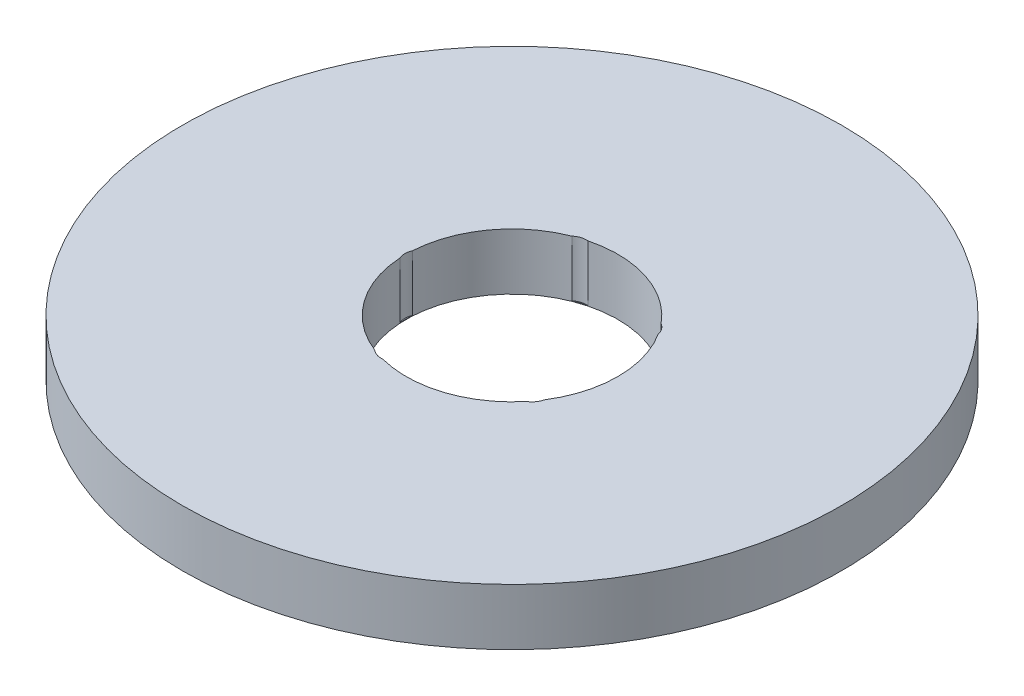
ISO-10303-21;
HEADER;
FILE_DESCRIPTION(('STEP AP214'),'2;1');
FILE_NAME('part.step','',(''),(''),'','','');
FILE_SCHEMA(('AUTOMOTIVE_DESIGN { 1 0 10303 214 1 1 1 1 }'));
ENDSEC;
DATA;
#1=APPLICATION_CONTEXT('core data for automotive mechanical design processes');
#2=APPLICATION_PROTOCOL_DEFINITION('international standard','automotive_design',2000,#1);
#3=PRODUCT_CONTEXT('',#1,'mechanical');
#4=PRODUCT('Part','Part','',(#3));
#5=PRODUCT_RELATED_PRODUCT_CATEGORY('part','',(#4));
#6=PRODUCT_DEFINITION_FORMATION('','',#4);
#7=PRODUCT_DEFINITION_CONTEXT('part definition',#1,'design');
#8=PRODUCT_DEFINITION('design','',#6,#7);
#9=PRODUCT_DEFINITION_SHAPE('','',#8);
#10=(LENGTH_UNIT() NAMED_UNIT(*) SI_UNIT(.MILLI.,.METRE.));
#11=(NAMED_UNIT(*) PLANE_ANGLE_UNIT() SI_UNIT($,.RADIAN.));
#12=(NAMED_UNIT(*) SI_UNIT($,.STERADIAN.) SOLID_ANGLE_UNIT());
#13=UNCERTAINTY_MEASURE_WITH_UNIT(LENGTH_MEASURE(1.E-05),#10,'distance_accuracy_value','');
#14=(GEOMETRIC_REPRESENTATION_CONTEXT(3) GLOBAL_UNCERTAINTY_ASSIGNED_CONTEXT((#13)) GLOBAL_UNIT_ASSIGNED_CONTEXT((#10,
#11,#12)) REPRESENTATION_CONTEXT('',''));
#15=CARTESIAN_POINT('',(0.,0.,0.));
#16=DIRECTION('',(0.,0.,1.));
#17=DIRECTION('',(1.,0.,0.));
#18=AXIS2_PLACEMENT_3D('',#15,#16,#17);
#19=CARTESIAN_POINT('',(0.,12.,0.));
#20=DIRECTION('',(0.,-1.,0.));
#21=DIRECTION('',(0.,0.,-1.));
#22=AXIS2_PLACEMENT_3D('',#19,#20,#21);
#23=CYLINDRICAL_SURFACE('',#22,70.);
#24=CARTESIAN_POINT('',(0.,12.,0.));
#25=DIRECTION('',(0.,1.,0.));
#26=DIRECTION('',(0.,0.,1.));
#27=AXIS2_PLACEMENT_3D('',#24,#25,#26);
#28=CIRCLE('',#27,70.);
#29=CARTESIAN_POINT('',(0.,12.,70.));
#30=VERTEX_POINT('',#29);
#31=EDGE_CURVE('E159',#30,#30,#28,.T.);
#32=ORIENTED_EDGE('',*,*,#31,.F.);
#33=EDGE_LOOP('',(#32));
#34=FACE_BOUND('',#33,.T.);
#35=CARTESIAN_POINT('',(0.,0.,0.));
#36=DIRECTION('',(0.,1.,0.));
#37=DIRECTION('',(0.,0.,1.));
#38=AXIS2_PLACEMENT_3D('',#35,#36,#37);
#39=CIRCLE('',#38,70.);
#40=CARTESIAN_POINT('',(0.,0.,70.));
#41=VERTEX_POINT('',#40);
#42=EDGE_CURVE('E152',#41,#41,#39,.T.);
#43=ORIENTED_EDGE('',*,*,#42,.T.);
#44=EDGE_LOOP('',(#43));
#45=FACE_BOUND('',#44,.T.);
#46=ADVANCED_FACE('F39',(#34,#45),#23,.T.);
#47=CARTESIAN_POINT('',(0.,12.,0.));
#48=DIRECTION('',(0.,1.,0.));
#49=DIRECTION('',(0.,0.,1.));
#50=AXIS2_PLACEMENT_3D('',#47,#48,#49);
#51=PLANE('',#50);
#52=CARTESIAN_POINT('',(-5.99042300739143,12.,18.4366262705647));
#53=DIRECTION('',(0.,1.,0.));
#54=DIRECTION('',(0.951056516295155,0.,0.309016994374945));
#55=AXIS2_PLACEMENT_3D('',#52,#53,#54);
#56=CIRCLE('',#55,3.35702302504497);
#57=CARTESIAN_POINT('',(-8.22321581409776,12.,20.943464891817));
#58=VERTEX_POINT('',#57);
#59=CARTESIAN_POINT('',(-5.65753845329719,12.,21.77710400052));
#60=VERTEX_POINT('',#59);
#61=EDGE_CURVE('E192',#58,#60,#56,.T.);
#62=ORIENTED_EDGE('',*,*,#61,.F.);
#63=CARTESIAN_POINT('',(0.,12.,0.));
#64=DIRECTION('',(0.,1.,0.));
#65=DIRECTION('',(0.,0.,1.));
#66=AXIS2_PLACEMENT_3D('',#63,#64,#65);
#67=CIRCLE('',#66,22.5);
#68=CARTESIAN_POINT('',(-22.4595321941304,12.,1.34885641223256));
#69=VERTEX_POINT('',#68);
#70=EDGE_CURVE('E147',#69,#58,#67,.T.);
#71=ORIENTED_EDGE('',*,*,#70,.F.);
#72=CARTESIAN_POINT('',(-19.3854160658976,12.,0.));
#73=DIRECTION('',(0.,1.,0.));
#74=DIRECTION('',(0.,0.,1.));
#75=AXIS2_PLACEMENT_3D('',#72,#73,#74);
#76=CIRCLE('',#75,3.35702302504497);
#77=CARTESIAN_POINT('',(-22.4595321941304,12.,-1.34885641223256));
#78=VERTEX_POINT('',#77);
#79=EDGE_CURVE('E154',#78,#69,#76,.T.);
#80=ORIENTED_EDGE('',*,*,#79,.F.);
#81=CARTESIAN_POINT('',(-8.22321581409805,12.,-20.9434648918169));
#82=VERTEX_POINT('',#81);
#83=EDGE_CURVE('E136',#82,#78,#67,.T.);
#84=ORIENTED_EDGE('',*,*,#83,.F.);
#85=CARTESIAN_POINT('',(-5.99042300739169,12.,-18.4366262705646));
#86=DIRECTION('',(0.,1.,0.));
#87=DIRECTION('',(-0.95105651629515,0.,0.309016994374958));
#88=AXIS2_PLACEMENT_3D('',#85,#86,#87);
#89=CIRCLE('',#88,3.35702302504497);
#90=CARTESIAN_POINT('',(-5.65753845329751,12.,-21.7771040005199));
#91=VERTEX_POINT('',#90);
#92=EDGE_CURVE('E117',#91,#82,#89,.T.);
#93=ORIENTED_EDGE('',*,*,#92,.F.);
#94=CARTESIAN_POINT('',(17.3773053241922,12.,-14.2926295575658));
#95=VERTEX_POINT('',#94);
#96=EDGE_CURVE('E133',#95,#91,#67,.T.);
#97=ORIENTED_EDGE('',*,*,#96,.F.);
#98=CARTESIAN_POINT('',(15.6831310403402,12.,-11.3944616730883));
#99=DIRECTION('',(0.,1.,0.));
#100=DIRECTION('',(-0.58778525229248,0.,-0.809016994374942));
#101=AXIS2_PLACEMENT_3D('',#98,#99,#100);
#102=CIRCLE('',#101,3.35702302504497);
#103=CARTESIAN_POINT('',(18.9629811373331,12.,-12.1101340366303));
#104=VERTEX_POINT('',#103);
#105=EDGE_CURVE('E333',#104,#95,#102,.T.);
#106=ORIENTED_EDGE('',*,*,#105,.F.);
#107=CARTESIAN_POINT('',(18.9629811373332,12.,12.11013403663));
#108=VERTEX_POINT('',#107);
#109=EDGE_CURVE('E144',#108,#104,#67,.T.);
#110=ORIENTED_EDGE('',*,*,#109,.F.);
#111=CARTESIAN_POINT('',(15.6831310403403,12.,11.3944616730881));
#112=DIRECTION('',(0.,1.,0.));
#113=DIRECTION('',(0.587785252292469,0.,-0.809016994374951));
#114=AXIS2_PLACEMENT_3D('',#111,#112,#113);
#115=CIRCLE('',#114,3.35702302504497);
#116=CARTESIAN_POINT('',(17.3773053241924,12.,14.2926295575655));
#117=VERTEX_POINT('',#116);
#118=EDGE_CURVE('E328',#117,#108,#115,.T.);
#119=ORIENTED_EDGE('',*,*,#118,.F.);
#120=EDGE_CURVE('E146',#60,#117,#67,.T.);
#121=ORIENTED_EDGE('',*,*,#120,.F.);
#122=EDGE_LOOP('',(#62,#71,#80,#84,#93,#97,#106,#110,#119,#121));
#123=FACE_BOUND('',#122,.T.);
#124=ORIENTED_EDGE('',*,*,#31,.T.);
#125=EDGE_LOOP('',(#124));
#126=FACE_BOUND('',#125,.T.);
#127=ADVANCED_FACE('F131',(#123,#126),#51,.T.);
#128=CARTESIAN_POINT('',(0.,0.,0.));
#129=DIRECTION('',(0.,1.,0.));
#130=DIRECTION('',(0.,0.,1.));
#131=AXIS2_PLACEMENT_3D('',#128,#129,#130);
#132=PLANE('',#131);
#133=CARTESIAN_POINT('',(0.,0.,0.));
#134=DIRECTION('',(0.,1.,0.));
#135=DIRECTION('',(0.,0.,1.));
#136=AXIS2_PLACEMENT_3D('',#133,#134,#135);
#137=CIRCLE('',#136,22.5);
#138=CARTESIAN_POINT('',(0.,0.,22.5));
#139=VERTEX_POINT('',#138);
#140=EDGE_CURVE('E149',#139,#139,#137,.T.);
#141=ORIENTED_EDGE('',*,*,#140,.T.);
#142=EDGE_LOOP('',(#141));
#143=FACE_BOUND('',#142,.T.);
#144=ORIENTED_EDGE('',*,*,#42,.F.);
#145=EDGE_LOOP('',(#144));
#146=FACE_BOUND('',#145,.T.);
#147=ADVANCED_FACE('F209',(#143,#146),#132,.F.);
#148=CARTESIAN_POINT('',(0.,12.,0.));
#149=DIRECTION('',(0.,-1.,0.));
#150=DIRECTION('',(0.,0.,-1.));
#151=AXIS2_PLACEMENT_3D('',#148,#149,#150);
#152=CYLINDRICAL_SURFACE('',#151,22.5);
#153=DIRECTION('',(0.,1.,0.));
#154=VECTOR('',#153,1.);
#155=CARTESIAN_POINT('',(-8.22321581409778,6.04354658408581,20.943464891817));
#156=LINE('',#155,#154);
#157=CARTESIAN_POINT('',(-8.22321581409776,0.0870931681716154,20.943464891817));
#158=VERTEX_POINT('',#157);
#159=EDGE_CURVE('E11',#158,#58,#156,.T.);
#160=ORIENTED_EDGE('',*,*,#159,.F.);
#161=CARTESIAN_POINT('',(0.,0.0870931681716154,0.));
#162=DIRECTION('',(0.,1.,0.));
#163=DIRECTION('',(0.,0.,1.));
#164=AXIS2_PLACEMENT_3D('',#161,#162,#163);
#165=CIRCLE('',#164,22.5);
#166=CARTESIAN_POINT('',(-5.65753845329719,0.0870931681716154,21.77710400052));
#167=VERTEX_POINT('',#166);
#168=EDGE_CURVE('E187',#158,#167,#165,.T.);
#169=ORIENTED_EDGE('',*,*,#168,.T.);
#170=DIRECTION('',(0.,1.,0.));
#171=VECTOR('',#170,1.);
#172=CARTESIAN_POINT('',(-5.65753845329717,6.04354658408581,21.77710400052));
#173=LINE('',#172,#171);
#174=EDGE_CURVE('E46',#60,#167,#173,.F.);
#175=ORIENTED_EDGE('',*,*,#174,.F.);
#176=ORIENTED_EDGE('',*,*,#120,.T.);
#177=DIRECTION('',(0.,1.,0.));
#178=VECTOR('',#177,1.);
#179=CARTESIAN_POINT('',(17.3773053241923,6.04354658408581,14.2926295575655));
#180=LINE('',#179,#178);
#181=CARTESIAN_POINT('',(17.3773053241924,0.0870931681716154,14.2926295575655));
#182=VERTEX_POINT('',#181);
#183=EDGE_CURVE('E186',#182,#117,#180,.T.);
#184=ORIENTED_EDGE('',*,*,#183,.F.);
#185=CARTESIAN_POINT('',(0.,0.0870931681716154,0.));
#186=DIRECTION('',(0.,1.,0.));
#187=DIRECTION('',(0.,0.,1.));
#188=AXIS2_PLACEMENT_3D('',#185,#186,#187);
#189=CIRCLE('',#188,22.5);
#190=CARTESIAN_POINT('',(18.9629811373332,0.0870931681716154,12.11013403663));
#191=VERTEX_POINT('',#190);
#192=EDGE_CURVE('E182',#182,#191,#189,.T.);
#193=ORIENTED_EDGE('',*,*,#192,.T.);
#194=DIRECTION('',(0.,1.,0.));
#195=VECTOR('',#194,1.);
#196=CARTESIAN_POINT('',(18.9629811373332,6.04354658408581,12.11013403663));
#197=LINE('',#196,#195);
#198=EDGE_CURVE('E184',#108,#191,#197,.F.);
#199=ORIENTED_EDGE('',*,*,#198,.F.);
#200=ORIENTED_EDGE('',*,*,#109,.T.);
#201=DIRECTION('',(0.,1.,0.));
#202=VECTOR('',#201,1.);
#203=CARTESIAN_POINT('',(18.9629811373331,6.04354658408581,-12.1101340366302));
#204=LINE('',#203,#202);
#205=CARTESIAN_POINT('',(18.9629811373331,0.0870931681716154,-12.1101340366303));
#206=VERTEX_POINT('',#205);
#207=EDGE_CURVE('E178',#206,#104,#204,.T.);
#208=ORIENTED_EDGE('',*,*,#207,.F.);
#209=CARTESIAN_POINT('',(0.,0.0870931681716154,0.));
#210=DIRECTION('',(0.,1.,0.));
#211=DIRECTION('',(0.,0.,1.));
#212=AXIS2_PLACEMENT_3D('',#209,#210,#211);
#213=CIRCLE('',#212,22.5);
#214=CARTESIAN_POINT('',(17.3773053241922,0.0870931681716154,-14.2926295575658));
#215=VERTEX_POINT('',#214);
#216=EDGE_CURVE('E123',#206,#215,#213,.T.);
#217=ORIENTED_EDGE('',*,*,#216,.T.);
#218=DIRECTION('',(0.,1.,0.));
#219=VECTOR('',#218,1.);
#220=CARTESIAN_POINT('',(17.3773053241921,6.04354658408581,-14.2926295575658));
#221=LINE('',#220,#219);
#222=EDGE_CURVE('E145',#95,#215,#221,.F.);
#223=ORIENTED_EDGE('',*,*,#222,.F.);
#224=ORIENTED_EDGE('',*,*,#96,.T.);
#225=DIRECTION('',(0.,1.,0.));
#226=VECTOR('',#225,1.);
#227=CARTESIAN_POINT('',(-5.65753845329747,6.04354658408581,-21.7771040005199));
#228=LINE('',#227,#226);
#229=CARTESIAN_POINT('',(-5.65753845329751,0.0870931681716154,-21.7771040005199));
#230=VERTEX_POINT('',#229);
#231=EDGE_CURVE('E111',#230,#91,#228,.T.);
#232=ORIENTED_EDGE('',*,*,#231,.F.);
#233=CARTESIAN_POINT('',(0.,0.0870931681716154,0.));
#234=DIRECTION('',(0.,1.,0.));
#235=DIRECTION('',(0.,0.,1.));
#236=AXIS2_PLACEMENT_3D('',#233,#234,#235);
#237=CIRCLE('',#236,22.5);
#238=CARTESIAN_POINT('',(-8.22321581409805,0.0870931681716154,-20.9434648918169));
#239=VERTEX_POINT('',#238);
#240=EDGE_CURVE('E173',#230,#239,#237,.T.);
#241=ORIENTED_EDGE('',*,*,#240,.T.);
#242=DIRECTION('',(0.,1.,0.));
#243=VECTOR('',#242,1.);
#244=CARTESIAN_POINT('',(-8.22321581409808,6.04354658408581,-20.9434648918169));
#245=LINE('',#244,#243);
#246=EDGE_CURVE('E124',#82,#239,#245,.F.);
#247=ORIENTED_EDGE('',*,*,#246,.F.);
#248=ORIENTED_EDGE('',*,*,#83,.T.);
#249=DIRECTION('',(0.,1.,0.));
#250=VECTOR('',#249,1.);
#251=CARTESIAN_POINT('',(-22.4595321941304,6.04354658408581,-1.34885641223259));
#252=LINE('',#251,#250);
#253=CARTESIAN_POINT('',(-22.4595321941304,0.0870931681716154,-1.34885641223256));
#254=VERTEX_POINT('',#253);
#255=EDGE_CURVE('E171',#254,#78,#252,.T.);
#256=ORIENTED_EDGE('',*,*,#255,.F.);
#257=CARTESIAN_POINT('',(0.,0.0870931681716154,0.));
#258=DIRECTION('',(0.,1.,0.));
#259=DIRECTION('',(0.,0.,1.));
#260=AXIS2_PLACEMENT_3D('',#257,#258,#259);
#261=CIRCLE('',#260,22.5);
#262=CARTESIAN_POINT('',(-22.4595321941304,0.0870931681716154,1.34885641223256));
#263=VERTEX_POINT('',#262);
#264=EDGE_CURVE('E162',#254,#263,#261,.T.);
#265=ORIENTED_EDGE('',*,*,#264,.T.);
#266=DIRECTION('',(0.,1.,0.));
#267=VECTOR('',#266,1.);
#268=CARTESIAN_POINT('',(-22.4595321941304,6.04354658408581,1.34885641223259));
#269=LINE('',#268,#267);
#270=EDGE_CURVE('E169',#69,#263,#269,.F.);
#271=ORIENTED_EDGE('',*,*,#270,.F.);
#272=ORIENTED_EDGE('',*,*,#70,.T.);
#273=EDGE_LOOP('',(#160,#169,#175,#176,#184,#193,#199,#200,#208,#217,#223,#224,#232,#241,#247,
#248,#256,#265,#271,#272));
#274=FACE_BOUND('',#273,.T.);
#275=ORIENTED_EDGE('',*,*,#140,.F.);
#276=EDGE_LOOP('',(#275));
#277=FACE_BOUND('',#276,.T.);
#278=ADVANCED_FACE('F139',(#274,#277),#152,.F.);
#279=CARTESIAN_POINT('',(-19.3854160658976,0.0870931681716154,0.));
#280=DIRECTION('',(0.,1.,0.));
#281=DIRECTION('',(0.,0.,1.));
#282=AXIS2_PLACEMENT_3D('',#279,#280,#281);
#283=CYLINDRICAL_SURFACE('',#282,3.35702302504497);
#284=ORIENTED_EDGE('',*,*,#255,.T.);
#285=ORIENTED_EDGE('',*,*,#79,.T.);
#286=ORIENTED_EDGE('',*,*,#270,.T.);
#287=CARTESIAN_POINT('',(-19.3854160658976,0.0870931681716154,0.));
#288=DIRECTION('',(0.,1.,0.));
#289=DIRECTION('',(0.,0.,1.));
#290=AXIS2_PLACEMENT_3D('',#287,#288,#289);
#291=CIRCLE('',#290,3.35702302504497);
#292=EDGE_CURVE('E157',#254,#263,#291,.T.);
#293=ORIENTED_EDGE('',*,*,#292,.F.);
#294=EDGE_LOOP('',(#284,#285,#286,#293));
#295=FACE_BOUND('',#294,.T.);
#296=ADVANCED_FACE('F222',(#295),#283,.F.);
#297=CARTESIAN_POINT('',(-19.3854160658976,0.0870931681716154,0.));
#298=DIRECTION('',(0.,1.,0.));
#299=DIRECTION('',(0.,0.,1.));
#300=AXIS2_PLACEMENT_3D('',#297,#298,#299);
#301=PLANE('',#300);
#302=ORIENTED_EDGE('',*,*,#292,.T.);
#303=ORIENTED_EDGE('',*,*,#264,.F.);
#304=EDGE_LOOP('',(#302,#303));
#305=FACE_BOUND('',#304,.T.);
#306=ADVANCED_FACE('F223',(#305),#301,.T.);
#307=CARTESIAN_POINT('',(-5.99042300739169,0.0870931681716154,-18.4366262705646));
#308=DIRECTION('',(0.,1.,0.));
#309=DIRECTION('',(0.,0.,1.));
#310=AXIS2_PLACEMENT_3D('',#307,#308,#309);
#311=CYLINDRICAL_SURFACE('',#310,3.35702302504497);
#312=ORIENTED_EDGE('',*,*,#231,.T.);
#313=ORIENTED_EDGE('',*,*,#92,.T.);
#314=ORIENTED_EDGE('',*,*,#246,.T.);
#315=CARTESIAN_POINT('',(-5.99042300739169,0.0870931681716154,-18.4366262705646));
#316=DIRECTION('',(0.,1.,0.));
#317=DIRECTION('',(-0.95105651629515,0.,0.309016994374958));
#318=AXIS2_PLACEMENT_3D('',#315,#316,#317);
#319=CIRCLE('',#318,3.35702302504497);
#320=EDGE_CURVE('E119',#230,#239,#319,.T.);
#321=ORIENTED_EDGE('',*,*,#320,.F.);
#322=EDGE_LOOP('',(#312,#313,#314,#321));
#323=FACE_BOUND('',#322,.T.);
#324=ADVANCED_FACE('F116',(#323),#311,.F.);
#325=CARTESIAN_POINT('',(-5.99042300739169,0.0870931681716154,-18.4366262705646));
#326=DIRECTION('',(0.,1.,0.));
#327=DIRECTION('',(-0.95105651629515,0.,0.309016994374958));
#328=AXIS2_PLACEMENT_3D('',#325,#326,#327);
#329=PLANE('',#328);
#330=ORIENTED_EDGE('',*,*,#320,.T.);
#331=ORIENTED_EDGE('',*,*,#240,.F.);
#332=EDGE_LOOP('',(#330,#331));
#333=FACE_BOUND('',#332,.T.);
#334=ADVANCED_FACE('F235',(#333),#329,.T.);
#335=CARTESIAN_POINT('',(15.6831310403402,0.0870931681716154,-11.3944616730883));
#336=DIRECTION('',(0.,1.,0.));
#337=DIRECTION('',(0.,0.,1.));
#338=AXIS2_PLACEMENT_3D('',#335,#336,#337);
#339=CYLINDRICAL_SURFACE('',#338,3.35702302504497);
#340=ORIENTED_EDGE('',*,*,#207,.T.);
#341=ORIENTED_EDGE('',*,*,#105,.T.);
#342=ORIENTED_EDGE('',*,*,#222,.T.);
#343=CARTESIAN_POINT('',(15.6831310403402,0.0870931681716154,-11.3944616730883));
#344=DIRECTION('',(0.,1.,0.));
#345=DIRECTION('',(-0.58778525229248,0.,-0.809016994374942));
#346=AXIS2_PLACEMENT_3D('',#343,#344,#345);
#347=CIRCLE('',#346,3.35702302504497);
#348=EDGE_CURVE('E335',#206,#215,#347,.T.);
#349=ORIENTED_EDGE('',*,*,#348,.F.);
#350=EDGE_LOOP('',(#340,#341,#342,#349));
#351=FACE_BOUND('',#350,.T.);
#352=ADVANCED_FACE('F234',(#351),#339,.F.);
#353=CARTESIAN_POINT('',(15.6831310403402,0.0870931681716154,-11.3944616730883));
#354=DIRECTION('',(0.,1.,0.));
#355=DIRECTION('',(-0.58778525229248,0.,-0.809016994374942));
#356=AXIS2_PLACEMENT_3D('',#353,#354,#355);
#357=PLANE('',#356);
#358=ORIENTED_EDGE('',*,*,#348,.T.);
#359=ORIENTED_EDGE('',*,*,#216,.F.);
#360=EDGE_LOOP('',(#358,#359));
#361=FACE_BOUND('',#360,.T.);
#362=ADVANCED_FACE('F239',(#361),#357,.T.);
#363=CARTESIAN_POINT('',(15.6831310403403,0.0870931681716154,11.3944616730881));
#364=DIRECTION('',(0.,1.,0.));
#365=DIRECTION('',(0.,0.,1.));
#366=AXIS2_PLACEMENT_3D('',#363,#364,#365);
#367=CYLINDRICAL_SURFACE('',#366,3.35702302504497);
#368=ORIENTED_EDGE('',*,*,#183,.T.);
#369=ORIENTED_EDGE('',*,*,#118,.T.);
#370=ORIENTED_EDGE('',*,*,#198,.T.);
#371=CARTESIAN_POINT('',(15.6831310403403,0.0870931681716154,11.3944616730881));
#372=DIRECTION('',(0.,1.,0.));
#373=DIRECTION('',(0.587785252292469,0.,-0.809016994374951));
#374=AXIS2_PLACEMENT_3D('',#371,#372,#373);
#375=CIRCLE('',#374,3.35702302504497);
#376=EDGE_CURVE('E56',#182,#191,#375,.T.);
#377=ORIENTED_EDGE('',*,*,#376,.F.);
#378=EDGE_LOOP('',(#368,#369,#370,#377));
#379=FACE_BOUND('',#378,.T.);
#380=ADVANCED_FACE('F242',(#379),#367,.F.);
#381=CARTESIAN_POINT('',(15.6831310403403,0.0870931681716154,11.3944616730881));
#382=DIRECTION('',(0.,1.,0.));
#383=DIRECTION('',(0.587785252292469,0.,-0.809016994374951));
#384=AXIS2_PLACEMENT_3D('',#381,#382,#383);
#385=PLANE('',#384);
#386=ORIENTED_EDGE('',*,*,#376,.T.);
#387=ORIENTED_EDGE('',*,*,#192,.F.);
#388=EDGE_LOOP('',(#386,#387));
#389=FACE_BOUND('',#388,.T.);
#390=ADVANCED_FACE('F205',(#389),#385,.T.);
#391=CARTESIAN_POINT('',(-5.99042300739143,0.0870931681716154,18.4366262705647));
#392=DIRECTION('',(0.,1.,0.));
#393=DIRECTION('',(0.,0.,1.));
#394=AXIS2_PLACEMENT_3D('',#391,#392,#393);
#395=CYLINDRICAL_SURFACE('',#394,3.35702302504497);
#396=ORIENTED_EDGE('',*,*,#159,.T.);
#397=ORIENTED_EDGE('',*,*,#61,.T.);
#398=ORIENTED_EDGE('',*,*,#174,.T.);
#399=CARTESIAN_POINT('',(-5.99042300739143,0.0870931681716154,18.4366262705647));
#400=DIRECTION('',(0.,1.,0.));
#401=DIRECTION('',(0.951056516295155,0.,0.309016994374945));
#402=AXIS2_PLACEMENT_3D('',#399,#400,#401);
#403=CIRCLE('',#402,3.35702302504497);
#404=EDGE_CURVE('E55',#158,#167,#403,.T.);
#405=ORIENTED_EDGE('',*,*,#404,.F.);
#406=EDGE_LOOP('',(#396,#397,#398,#405));
#407=FACE_BOUND('',#406,.T.);
#408=ADVANCED_FACE('F195',(#407),#395,.F.);
#409=CARTESIAN_POINT('',(-5.99042300739143,0.0870931681716154,18.4366262705647));
#410=DIRECTION('',(0.,1.,0.));
#411=DIRECTION('',(0.951056516295155,0.,0.309016994374945));
#412=AXIS2_PLACEMENT_3D('',#409,#410,#411);
#413=PLANE('',#412);
#414=ORIENTED_EDGE('',*,*,#404,.T.);
#415=ORIENTED_EDGE('',*,*,#168,.F.);
#416=EDGE_LOOP('',(#414,#415));
#417=FACE_BOUND('',#416,.T.);
#418=ADVANCED_FACE('F198',(#417),#413,.T.);
#419=CLOSED_SHELL('',(#46,#127,#147,#278,#296,#306,#324,#334,#352,#362,#380,#390,#408,#418));
#420=MANIFOLD_SOLID_BREP('B2',#419);
#421=ADVANCED_BREP_SHAPE_REPRESENTATION('',(#18,#420),#14);
#422=SHAPE_DEFINITION_REPRESENTATION(#9,#421);
ENDSEC;
END-ISO-10303-21;
